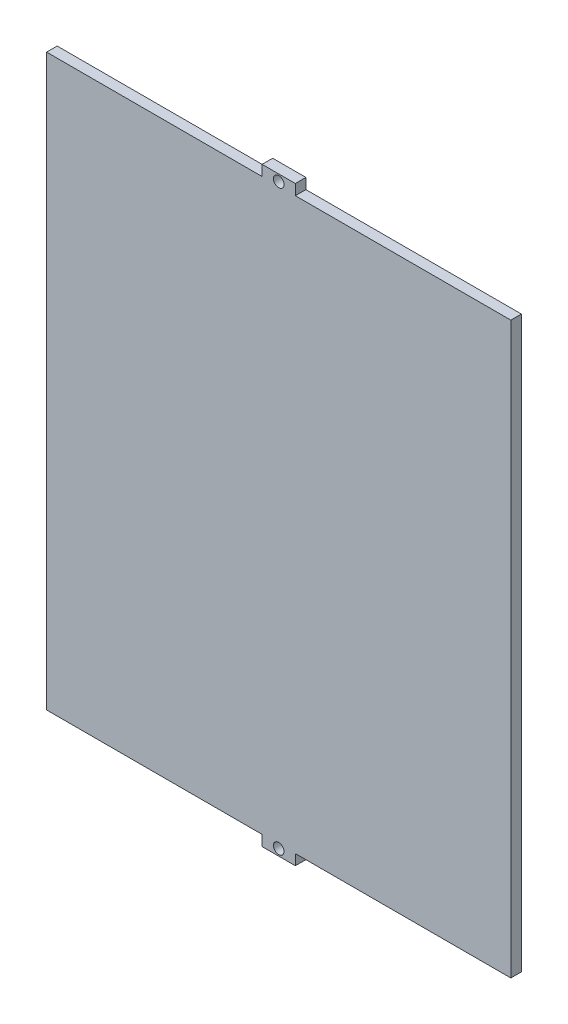
ISO-10303-21;
HEADER;
FILE_DESCRIPTION(('STEP AP214'),'2;1');
FILE_NAME('part.step','',(''),(''),'','','');
FILE_SCHEMA(('AUTOMOTIVE_DESIGN { 1 0 10303 214 1 1 1 1 }'));
ENDSEC;
DATA;
#1=APPLICATION_CONTEXT('core data for automotive mechanical design processes');
#2=APPLICATION_PROTOCOL_DEFINITION('international standard','automotive_design',2000,#1);
#3=PRODUCT_CONTEXT('',#1,'mechanical');
#4=PRODUCT('Part','Part','',(#3));
#5=PRODUCT_RELATED_PRODUCT_CATEGORY('part','',(#4));
#6=PRODUCT_DEFINITION_FORMATION('','',#4);
#7=PRODUCT_DEFINITION_CONTEXT('part definition',#1,'design');
#8=PRODUCT_DEFINITION('design','',#6,#7);
#9=PRODUCT_DEFINITION_SHAPE('','',#8);
#10=(LENGTH_UNIT() NAMED_UNIT(*) SI_UNIT(.MILLI.,.METRE.));
#11=(NAMED_UNIT(*) PLANE_ANGLE_UNIT() SI_UNIT($,.RADIAN.));
#12=(NAMED_UNIT(*) SI_UNIT($,.STERADIAN.) SOLID_ANGLE_UNIT());
#13=UNCERTAINTY_MEASURE_WITH_UNIT(LENGTH_MEASURE(1.E-05),#10,'distance_accuracy_value','');
#14=(GEOMETRIC_REPRESENTATION_CONTEXT(3) GLOBAL_UNCERTAINTY_ASSIGNED_CONTEXT((#13)) GLOBAL_UNIT_ASSIGNED_CONTEXT((#10,
#11,#12)) REPRESENTATION_CONTEXT('',''));
#15=CARTESIAN_POINT('',(0.,0.,0.));
#16=DIRECTION('',(0.,0.,1.));
#17=DIRECTION('',(1.,0.,0.));
#18=AXIS2_PLACEMENT_3D('',#15,#16,#17);
#19=CARTESIAN_POINT('',(69.85,88.9,3.18));
#20=DIRECTION('',(-1.,0.,0.));
#21=DIRECTION('',(0.,-1.,0.));
#22=AXIS2_PLACEMENT_3D('',#19,#20,#21);
#23=PLANE('',#22);
#24=DIRECTION('',(0.,1.,0.));
#25=VECTOR('',#24,1.);
#26=CARTESIAN_POINT('',(69.85,88.9,3.18));
#27=LINE('',#26,#25);
#28=CARTESIAN_POINT('',(69.85,-85.72,3.18));
#29=VERTEX_POINT('',#28);
#30=CARTESIAN_POINT('',(69.85,85.72,3.18));
#31=VERTEX_POINT('',#30);
#32=EDGE_CURVE('E150',#29,#31,#27,.T.);
#33=ORIENTED_EDGE('',*,*,#32,.F.);
#34=DIRECTION('',(0.,0.,1.));
#35=VECTOR('',#34,1.);
#36=CARTESIAN_POINT('',(69.85,-85.72,-6.82));
#37=LINE('',#36,#35);
#38=CARTESIAN_POINT('',(69.85,-85.72,0.));
#39=VERTEX_POINT('',#38);
#40=EDGE_CURVE('E225',#39,#29,#37,.T.);
#41=ORIENTED_EDGE('',*,*,#40,.F.);
#42=DIRECTION('',(0.,1.,0.));
#43=VECTOR('',#42,1.);
#44=CARTESIAN_POINT('',(69.85,88.9,0.));
#45=LINE('',#44,#43);
#46=CARTESIAN_POINT('',(69.85,85.72,0.));
#47=VERTEX_POINT('',#46);
#48=EDGE_CURVE('E162',#39,#47,#45,.T.);
#49=ORIENTED_EDGE('',*,*,#48,.T.);
#50=DIRECTION('',(0.,0.,1.));
#51=VECTOR('',#50,1.);
#52=CARTESIAN_POINT('',(69.85,85.72,-6.82));
#53=LINE('',#52,#51);
#54=EDGE_CURVE('E234',#47,#31,#53,.T.);
#55=ORIENTED_EDGE('',*,*,#54,.T.);
#56=EDGE_LOOP('',(#33,#41,#49,#55));
#57=FACE_BOUND('',#56,.T.);
#58=ADVANCED_FACE('F35',(#57),#23,.F.);
#59=CARTESIAN_POINT('',(-69.85,88.9,3.18));
#60=DIRECTION('',(0.,-1.,0.));
#61=DIRECTION('',(0.,0.,-1.));
#62=AXIS2_PLACEMENT_3D('',#59,#60,#61);
#63=PLANE('',#62);
#64=DIRECTION('',(-1.,0.,0.));
#65=VECTOR('',#64,1.);
#66=CARTESIAN_POINT('',(-69.85,88.9,0.));
#67=LINE('',#66,#65);
#68=CARTESIAN_POINT('',(5.,88.9,0.));
#69=VERTEX_POINT('',#68);
#70=CARTESIAN_POINT('',(-5.,88.9,0.));
#71=VERTEX_POINT('',#70);
#72=EDGE_CURVE('E165',#69,#71,#67,.T.);
#73=ORIENTED_EDGE('',*,*,#72,.T.);
#74=DIRECTION('',(0.,0.,1.));
#75=VECTOR('',#74,1.);
#76=CARTESIAN_POINT('',(-5.,88.9,-6.82));
#77=LINE('',#76,#75);
#78=CARTESIAN_POINT('',(-5.,88.9,3.18));
#79=VERTEX_POINT('',#78);
#80=EDGE_CURVE('E148',#71,#79,#77,.T.);
#81=ORIENTED_EDGE('',*,*,#80,.T.);
#82=DIRECTION('',(-1.,0.,0.));
#83=VECTOR('',#82,1.);
#84=CARTESIAN_POINT('',(-69.85,88.9,3.18));
#85=LINE('',#84,#83);
#86=CARTESIAN_POINT('',(5.,88.9,3.18));
#87=VERTEX_POINT('',#86);
#88=EDGE_CURVE('E143',#87,#79,#85,.T.);
#89=ORIENTED_EDGE('',*,*,#88,.F.);
#90=DIRECTION('',(0.,0.,1.));
#91=VECTOR('',#90,1.);
#92=CARTESIAN_POINT('',(5.,88.9,-6.82));
#93=LINE('',#92,#91);
#94=EDGE_CURVE('E125',#69,#87,#93,.T.);
#95=ORIENTED_EDGE('',*,*,#94,.F.);
#96=EDGE_LOOP('',(#73,#81,#89,#95));
#97=FACE_BOUND('',#96,.T.);
#98=ADVANCED_FACE('F147',(#97),#63,.F.);
#99=CARTESIAN_POINT('',(-69.85,88.9,3.18));
#100=DIRECTION('',(1.,0.,0.));
#101=DIRECTION('',(0.,1.,0.));
#102=AXIS2_PLACEMENT_3D('',#99,#100,#101);
#103=PLANE('',#102);
#104=DIRECTION('',(0.,-1.,0.));
#105=VECTOR('',#104,1.);
#106=CARTESIAN_POINT('',(-69.85,88.9,3.18));
#107=LINE('',#106,#105);
#108=CARTESIAN_POINT('',(-69.85,85.72,3.18));
#109=VERTEX_POINT('',#108);
#110=CARTESIAN_POINT('',(-69.85,-85.72,3.18));
#111=VERTEX_POINT('',#110);
#112=EDGE_CURVE('E149',#109,#111,#107,.T.);
#113=ORIENTED_EDGE('',*,*,#112,.F.);
#114=DIRECTION('',(0.,0.,1.));
#115=VECTOR('',#114,1.);
#116=CARTESIAN_POINT('',(-69.85,85.72,-6.82));
#117=LINE('',#116,#115);
#118=CARTESIAN_POINT('',(-69.85,85.72,0.));
#119=VERTEX_POINT('',#118);
#120=EDGE_CURVE('E215',#119,#109,#117,.T.);
#121=ORIENTED_EDGE('',*,*,#120,.F.);
#122=DIRECTION('',(0.,-1.,0.));
#123=VECTOR('',#122,1.);
#124=CARTESIAN_POINT('',(-69.85,88.9,0.));
#125=LINE('',#124,#123);
#126=CARTESIAN_POINT('',(-69.85,-85.72,0.));
#127=VERTEX_POINT('',#126);
#128=EDGE_CURVE('E167',#119,#127,#125,.T.);
#129=ORIENTED_EDGE('',*,*,#128,.T.);
#130=DIRECTION('',(0.,0.,1.));
#131=VECTOR('',#130,1.);
#132=CARTESIAN_POINT('',(-69.85,-85.72,-6.82));
#133=LINE('',#132,#131);
#134=EDGE_CURVE('E190',#127,#111,#133,.T.);
#135=ORIENTED_EDGE('',*,*,#134,.T.);
#136=EDGE_LOOP('',(#113,#121,#129,#135));
#137=FACE_BOUND('',#136,.T.);
#138=ADVANCED_FACE('F257',(#137),#103,.F.);
#139=CARTESIAN_POINT('',(-69.85,-88.9,3.18));
#140=DIRECTION('',(0.,1.,0.));
#141=DIRECTION('',(0.,0.,1.));
#142=AXIS2_PLACEMENT_3D('',#139,#140,#141);
#143=PLANE('',#142);
#144=DIRECTION('',(1.,0.,0.));
#145=VECTOR('',#144,1.);
#146=CARTESIAN_POINT('',(-69.85,-88.9,0.));
#147=LINE('',#146,#145);
#148=CARTESIAN_POINT('',(-5.,-88.9,0.));
#149=VERTEX_POINT('',#148);
#150=CARTESIAN_POINT('',(5.,-88.9,0.));
#151=VERTEX_POINT('',#150);
#152=EDGE_CURVE('E155',#149,#151,#147,.T.);
#153=ORIENTED_EDGE('',*,*,#152,.T.);
#154=DIRECTION('',(0.,0.,1.));
#155=VECTOR('',#154,1.);
#156=CARTESIAN_POINT('',(5.,-88.9,-6.82));
#157=LINE('',#156,#155);
#158=CARTESIAN_POINT('',(5.,-88.9,3.18));
#159=VERTEX_POINT('',#158);
#160=EDGE_CURVE('E211',#151,#159,#157,.T.);
#161=ORIENTED_EDGE('',*,*,#160,.T.);
#162=DIRECTION('',(1.,0.,0.));
#163=VECTOR('',#162,1.);
#164=CARTESIAN_POINT('',(-69.85,-88.9,3.18));
#165=LINE('',#164,#163);
#166=CARTESIAN_POINT('',(-5.,-88.9,3.18));
#167=VERTEX_POINT('',#166);
#168=EDGE_CURVE('E153',#167,#159,#165,.T.);
#169=ORIENTED_EDGE('',*,*,#168,.F.);
#170=DIRECTION('',(0.,0.,1.));
#171=VECTOR('',#170,1.);
#172=CARTESIAN_POINT('',(-5.,-88.9,-6.82));
#173=LINE('',#172,#171);
#174=EDGE_CURVE('E199',#149,#167,#173,.T.);
#175=ORIENTED_EDGE('',*,*,#174,.F.);
#176=EDGE_LOOP('',(#153,#161,#169,#175));
#177=FACE_BOUND('',#176,.T.);
#178=ADVANCED_FACE('F264',(#177),#143,.F.);
#179=CARTESIAN_POINT('',(0.,0.,3.18));
#180=DIRECTION('',(0.,0.,1.));
#181=DIRECTION('',(1.,0.,0.));
#182=AXIS2_PLACEMENT_3D('',#179,#180,#181);
#183=PLANE('',#182);
#184=CARTESIAN_POINT('',(0.,86.9,3.18));
#185=DIRECTION('',(0.,0.,1.));
#186=DIRECTION('',(-1.,0.,0.));
#187=AXIS2_PLACEMENT_3D('',#184,#185,#186);
#188=CIRCLE('',#187,1.59);
#189=CARTESIAN_POINT('',(-1.59,86.9,3.18));
#190=VERTEX_POINT('',#189);
#191=EDGE_CURVE('E231',#190,#190,#188,.T.);
#192=ORIENTED_EDGE('',*,*,#191,.F.);
#193=EDGE_LOOP('',(#192));
#194=FACE_BOUND('',#193,.T.);
#195=CARTESIAN_POINT('',(0.,-86.9,3.18));
#196=DIRECTION('',(0.,0.,1.));
#197=DIRECTION('',(1.,0.,0.));
#198=AXIS2_PLACEMENT_3D('',#195,#196,#197);
#199=CIRCLE('',#198,1.59);
#200=CARTESIAN_POINT('',(1.59,-86.9,3.18));
#201=VERTEX_POINT('',#200);
#202=EDGE_CURVE('E224',#201,#201,#199,.T.);
#203=ORIENTED_EDGE('',*,*,#202,.F.);
#204=EDGE_LOOP('',(#203));
#205=FACE_BOUND('',#204,.T.);
#206=DIRECTION('',(0.,1.,0.));
#207=VECTOR('',#206,1.);
#208=CARTESIAN_POINT('',(-5.,88.9,3.18));
#209=LINE('',#208,#207);
#210=CARTESIAN_POINT('',(-5.,85.72,3.18));
#211=VERTEX_POINT('',#210);
#212=EDGE_CURVE('E217',#211,#79,#209,.T.);
#213=ORIENTED_EDGE('',*,*,#212,.F.);
#214=DIRECTION('',(1.,0.,0.));
#215=VECTOR('',#214,1.);
#216=CARTESIAN_POINT('',(-69.85,85.72,3.18));
#217=LINE('',#216,#215);
#218=EDGE_CURVE('E222',#109,#211,#217,.T.);
#219=ORIENTED_EDGE('',*,*,#218,.F.);
#220=ORIENTED_EDGE('',*,*,#112,.T.);
#221=DIRECTION('',(-1.,0.,0.));
#222=VECTOR('',#221,1.);
#223=CARTESIAN_POINT('',(-69.85,-85.72,3.18));
#224=LINE('',#223,#222);
#225=CARTESIAN_POINT('',(-5.,-85.72,3.18));
#226=VERTEX_POINT('',#225);
#227=EDGE_CURVE('E202',#226,#111,#224,.T.);
#228=ORIENTED_EDGE('',*,*,#227,.F.);
#229=DIRECTION('',(0.,1.,0.));
#230=VECTOR('',#229,1.);
#231=CARTESIAN_POINT('',(-5.,-88.9,3.18));
#232=LINE('',#231,#230);
#233=EDGE_CURVE('E208',#167,#226,#232,.T.);
#234=ORIENTED_EDGE('',*,*,#233,.F.);
#235=ORIENTED_EDGE('',*,*,#168,.T.);
#236=DIRECTION('',(0.,-1.,0.));
#237=VECTOR('',#236,1.);
#238=CARTESIAN_POINT('',(5.,-88.9,3.18));
#239=LINE('',#238,#237);
#240=CARTESIAN_POINT('',(5.,-85.72,3.18));
#241=VERTEX_POINT('',#240);
#242=EDGE_CURVE('E227',#241,#159,#239,.T.);
#243=ORIENTED_EDGE('',*,*,#242,.F.);
#244=DIRECTION('',(-1.,0.,0.));
#245=VECTOR('',#244,1.);
#246=CARTESIAN_POINT('',(69.85,-85.72,3.18));
#247=LINE('',#246,#245);
#248=EDGE_CURVE('E220',#29,#241,#247,.T.);
#249=ORIENTED_EDGE('',*,*,#248,.F.);
#250=ORIENTED_EDGE('',*,*,#32,.T.);
#251=DIRECTION('',(1.,0.,0.));
#252=VECTOR('',#251,1.);
#253=CARTESIAN_POINT('',(69.85,85.72,3.18));
#254=LINE('',#253,#252);
#255=CARTESIAN_POINT('',(5.,85.72,3.18));
#256=VERTEX_POINT('',#255);
#257=EDGE_CURVE('E137',#256,#31,#254,.T.);
#258=ORIENTED_EDGE('',*,*,#257,.F.);
#259=DIRECTION('',(0.,-1.,0.));
#260=VECTOR('',#259,1.);
#261=CARTESIAN_POINT('',(5.,88.9,3.18));
#262=LINE('',#261,#260);
#263=EDGE_CURVE('E128',#87,#256,#262,.T.);
#264=ORIENTED_EDGE('',*,*,#263,.F.);
#265=ORIENTED_EDGE('',*,*,#88,.T.);
#266=EDGE_LOOP('',(#213,#219,#220,#228,#234,#235,#243,#249,#250,#258,#264,#265));
#267=FACE_BOUND('',#266,.T.);
#268=ADVANCED_FACE('F142',(#194,#205,#267),#183,.T.);
#269=CARTESIAN_POINT('',(0.,0.,0.));
#270=DIRECTION('',(0.,0.,1.));
#271=DIRECTION('',(1.,0.,0.));
#272=AXIS2_PLACEMENT_3D('',#269,#270,#271);
#273=PLANE('',#272);
#274=CARTESIAN_POINT('',(0.,86.9,0.));
#275=DIRECTION('',(0.,0.,1.));
#276=DIRECTION('',(1.,0.,0.));
#277=AXIS2_PLACEMENT_3D('',#274,#275,#276);
#278=CIRCLE('',#277,1.59);
#279=CARTESIAN_POINT('',(1.59,86.9,0.));
#280=VERTEX_POINT('',#279);
#281=EDGE_CURVE('E38',#280,#280,#278,.T.);
#282=ORIENTED_EDGE('',*,*,#281,.T.);
#283=EDGE_LOOP('',(#282));
#284=FACE_BOUND('',#283,.T.);
#285=CARTESIAN_POINT('',(0.,-86.9,0.));
#286=DIRECTION('',(0.,0.,1.));
#287=DIRECTION('',(1.,0.,0.));
#288=AXIS2_PLACEMENT_3D('',#285,#286,#287);
#289=CIRCLE('',#288,1.59);
#290=CARTESIAN_POINT('',(1.59,-86.9,0.));
#291=VERTEX_POINT('',#290);
#292=EDGE_CURVE('E188',#291,#291,#289,.T.);
#293=ORIENTED_EDGE('',*,*,#292,.T.);
#294=EDGE_LOOP('',(#293));
#295=FACE_BOUND('',#294,.T.);
#296=DIRECTION('',(1.,0.,0.));
#297=VECTOR('',#296,1.);
#298=CARTESIAN_POINT('',(0.,85.72,0.));
#299=LINE('',#298,#297);
#300=CARTESIAN_POINT('',(-5.,85.72,0.));
#301=VERTEX_POINT('',#300);
#302=EDGE_CURVE('E43',#119,#301,#299,.T.);
#303=ORIENTED_EDGE('',*,*,#302,.T.);
#304=DIRECTION('',(0.,1.,0.));
#305=VECTOR('',#304,1.);
#306=CARTESIAN_POINT('',(-4.99999999999986,0.,0.));
#307=LINE('',#306,#305);
#308=EDGE_CURVE('E11',#301,#71,#307,.T.);
#309=ORIENTED_EDGE('',*,*,#308,.T.);
#310=ORIENTED_EDGE('',*,*,#72,.F.);
#311=DIRECTION('',(0.,-1.,0.));
#312=VECTOR('',#311,1.);
#313=CARTESIAN_POINT('',(4.99999999999986,0.,0.));
#314=LINE('',#313,#312);
#315=CARTESIAN_POINT('',(5.,85.72,0.));
#316=VERTEX_POINT('',#315);
#317=EDGE_CURVE('E131',#69,#316,#314,.T.);
#318=ORIENTED_EDGE('',*,*,#317,.T.);
#319=DIRECTION('',(1.,0.,0.));
#320=VECTOR('',#319,1.);
#321=CARTESIAN_POINT('',(0.,85.72,0.));
#322=LINE('',#321,#320);
#323=EDGE_CURVE('E178',#316,#47,#322,.T.);
#324=ORIENTED_EDGE('',*,*,#323,.T.);
#325=ORIENTED_EDGE('',*,*,#48,.F.);
#326=DIRECTION('',(-1.,0.,0.));
#327=VECTOR('',#326,1.);
#328=CARTESIAN_POINT('',(0.,-85.72,0.));
#329=LINE('',#328,#327);
#330=CARTESIAN_POINT('',(5.,-85.72,0.));
#331=VERTEX_POINT('',#330);
#332=EDGE_CURVE('E181',#39,#331,#329,.T.);
#333=ORIENTED_EDGE('',*,*,#332,.T.);
#334=DIRECTION('',(0.,-1.,0.));
#335=VECTOR('',#334,1.);
#336=CARTESIAN_POINT('',(4.99999999999986,0.,0.));
#337=LINE('',#336,#335);
#338=EDGE_CURVE('E184',#331,#151,#337,.T.);
#339=ORIENTED_EDGE('',*,*,#338,.T.);
#340=ORIENTED_EDGE('',*,*,#152,.F.);
#341=DIRECTION('',(0.,1.,0.));
#342=VECTOR('',#341,1.);
#343=CARTESIAN_POINT('',(-4.99999999999986,0.,0.));
#344=LINE('',#343,#342);
#345=CARTESIAN_POINT('',(-5.,-85.72,0.));
#346=VERTEX_POINT('',#345);
#347=EDGE_CURVE('E161',#149,#346,#344,.T.);
#348=ORIENTED_EDGE('',*,*,#347,.T.);
#349=DIRECTION('',(-1.,0.,0.));
#350=VECTOR('',#349,1.);
#351=CARTESIAN_POINT('',(0.,-85.72,0.));
#352=LINE('',#351,#350);
#353=EDGE_CURVE('E174',#346,#127,#352,.T.);
#354=ORIENTED_EDGE('',*,*,#353,.T.);
#355=ORIENTED_EDGE('',*,*,#128,.F.);
#356=EDGE_LOOP('',(#303,#309,#310,#318,#324,#325,#333,#339,#340,#348,#354,#355));
#357=FACE_BOUND('',#356,.T.);
#358=ADVANCED_FACE('F251',(#284,#295,#357),#273,.F.);
#359=CARTESIAN_POINT('',(-69.85,-85.72,-6.82));
#360=DIRECTION('',(0.,1.,0.));
#361=DIRECTION('',(0.,0.,1.));
#362=AXIS2_PLACEMENT_3D('',#359,#360,#361);
#363=PLANE('',#362);
#364=DIRECTION('',(0.,0.,1.));
#365=VECTOR('',#364,1.);
#366=CARTESIAN_POINT('',(-5.,-85.72,-6.82));
#367=LINE('',#366,#365);
#368=EDGE_CURVE('E195',#346,#226,#367,.T.);
#369=ORIENTED_EDGE('',*,*,#368,.T.);
#370=ORIENTED_EDGE('',*,*,#227,.T.);
#371=ORIENTED_EDGE('',*,*,#134,.F.);
#372=ORIENTED_EDGE('',*,*,#353,.F.);
#373=EDGE_LOOP('',(#369,#370,#371,#372));
#374=FACE_BOUND('',#373,.T.);
#375=ADVANCED_FACE('F260',(#374),#363,.F.);
#376=CARTESIAN_POINT('',(-5.,-88.9,-6.82));
#377=DIRECTION('',(1.,0.,0.));
#378=DIRECTION('',(0.,1.,0.));
#379=AXIS2_PLACEMENT_3D('',#376,#377,#378);
#380=PLANE('',#379);
#381=ORIENTED_EDGE('',*,*,#174,.T.);
#382=ORIENTED_EDGE('',*,*,#233,.T.);
#383=ORIENTED_EDGE('',*,*,#368,.F.);
#384=ORIENTED_EDGE('',*,*,#347,.F.);
#385=EDGE_LOOP('',(#381,#382,#383,#384));
#386=FACE_BOUND('',#385,.T.);
#387=ADVANCED_FACE('F261',(#386),#380,.F.);
#388=CARTESIAN_POINT('',(69.85,85.72,-6.82));
#389=DIRECTION('',(0.,-1.,0.));
#390=DIRECTION('',(0.,0.,-1.));
#391=AXIS2_PLACEMENT_3D('',#388,#389,#390);
#392=PLANE('',#391);
#393=DIRECTION('',(0.,0.,1.));
#394=VECTOR('',#393,1.);
#395=CARTESIAN_POINT('',(5.,85.72,-6.82));
#396=LINE('',#395,#394);
#397=EDGE_CURVE('E136',#316,#256,#396,.T.);
#398=ORIENTED_EDGE('',*,*,#397,.T.);
#399=ORIENTED_EDGE('',*,*,#257,.T.);
#400=ORIENTED_EDGE('',*,*,#54,.F.);
#401=ORIENTED_EDGE('',*,*,#323,.F.);
#402=EDGE_LOOP('',(#398,#399,#400,#401));
#403=FACE_BOUND('',#402,.T.);
#404=ADVANCED_FACE('F241',(#403),#392,.F.);
#405=CARTESIAN_POINT('',(5.,88.9,-6.82));
#406=DIRECTION('',(-1.,0.,0.));
#407=DIRECTION('',(0.,-1.,0.));
#408=AXIS2_PLACEMENT_3D('',#405,#406,#407);
#409=PLANE('',#408);
#410=ORIENTED_EDGE('',*,*,#94,.T.);
#411=ORIENTED_EDGE('',*,*,#263,.T.);
#412=ORIENTED_EDGE('',*,*,#397,.F.);
#413=ORIENTED_EDGE('',*,*,#317,.F.);
#414=EDGE_LOOP('',(#410,#411,#412,#413));
#415=FACE_BOUND('',#414,.T.);
#416=ADVANCED_FACE('F127',(#415),#409,.F.);
#417=CARTESIAN_POINT('',(5.,-88.9,-6.82));
#418=DIRECTION('',(-1.,0.,0.));
#419=DIRECTION('',(0.,-1.,0.));
#420=AXIS2_PLACEMENT_3D('',#417,#418,#419);
#421=PLANE('',#420);
#422=DIRECTION('',(0.,0.,1.));
#423=VECTOR('',#422,1.);
#424=CARTESIAN_POINT('',(5.,-85.72,-6.82));
#425=LINE('',#424,#423);
#426=EDGE_CURVE('E59',#331,#241,#425,.T.);
#427=ORIENTED_EDGE('',*,*,#426,.T.);
#428=ORIENTED_EDGE('',*,*,#242,.T.);
#429=ORIENTED_EDGE('',*,*,#160,.F.);
#430=ORIENTED_EDGE('',*,*,#338,.F.);
#431=EDGE_LOOP('',(#427,#428,#429,#430));
#432=FACE_BOUND('',#431,.T.);
#433=ADVANCED_FACE('F266',(#432),#421,.F.);
#434=CARTESIAN_POINT('',(69.85,-85.72,-6.82));
#435=DIRECTION('',(0.,1.,0.));
#436=DIRECTION('',(0.,0.,1.));
#437=AXIS2_PLACEMENT_3D('',#434,#435,#436);
#438=PLANE('',#437);
#439=ORIENTED_EDGE('',*,*,#40,.T.);
#440=ORIENTED_EDGE('',*,*,#248,.T.);
#441=ORIENTED_EDGE('',*,*,#426,.F.);
#442=ORIENTED_EDGE('',*,*,#332,.F.);
#443=EDGE_LOOP('',(#439,#440,#441,#442));
#444=FACE_BOUND('',#443,.T.);
#445=ADVANCED_FACE('F249',(#444),#438,.F.);
#446=CARTESIAN_POINT('',(-5.,88.9,-6.82));
#447=DIRECTION('',(1.,0.,0.));
#448=DIRECTION('',(0.,1.,0.));
#449=AXIS2_PLACEMENT_3D('',#446,#447,#448);
#450=PLANE('',#449);
#451=DIRECTION('',(0.,0.,1.));
#452=VECTOR('',#451,1.);
#453=CARTESIAN_POINT('',(-5.,85.72,-6.82));
#454=LINE('',#453,#452);
#455=EDGE_CURVE('E51',#301,#211,#454,.T.);
#456=ORIENTED_EDGE('',*,*,#455,.T.);
#457=ORIENTED_EDGE('',*,*,#212,.T.);
#458=ORIENTED_EDGE('',*,*,#80,.F.);
#459=ORIENTED_EDGE('',*,*,#308,.F.);
#460=EDGE_LOOP('',(#456,#457,#458,#459));
#461=FACE_BOUND('',#460,.T.);
#462=ADVANCED_FACE('F254',(#461),#450,.F.);
#463=CARTESIAN_POINT('',(-69.85,85.72,-6.82));
#464=DIRECTION('',(0.,-1.,0.));
#465=DIRECTION('',(0.,0.,-1.));
#466=AXIS2_PLACEMENT_3D('',#463,#464,#465);
#467=PLANE('',#466);
#468=ORIENTED_EDGE('',*,*,#120,.T.);
#469=ORIENTED_EDGE('',*,*,#218,.T.);
#470=ORIENTED_EDGE('',*,*,#455,.F.);
#471=ORIENTED_EDGE('',*,*,#302,.F.);
#472=EDGE_LOOP('',(#468,#469,#470,#471));
#473=FACE_BOUND('',#472,.T.);
#474=ADVANCED_FACE('F297',(#473),#467,.F.);
#475=CARTESIAN_POINT('',(0.,-86.9,-6.82));
#476=DIRECTION('',(0.,0.,1.));
#477=DIRECTION('',(1.,0.,0.));
#478=AXIS2_PLACEMENT_3D('',#475,#476,#477);
#479=CYLINDRICAL_SURFACE('',#478,1.59);
#480=ORIENTED_EDGE('',*,*,#202,.T.);
#481=EDGE_LOOP('',(#480));
#482=FACE_BOUND('',#481,.T.);
#483=ORIENTED_EDGE('',*,*,#292,.F.);
#484=EDGE_LOOP('',(#483));
#485=FACE_BOUND('',#484,.T.);
#486=ADVANCED_FACE('F300',(#482,#485),#479,.F.);
#487=CARTESIAN_POINT('',(0.,86.9,-6.82));
#488=DIRECTION('',(0.,0.,1.));
#489=DIRECTION('',(1.,0.,0.));
#490=AXIS2_PLACEMENT_3D('',#487,#488,#489);
#491=CYLINDRICAL_SURFACE('',#490,1.59);
#492=ORIENTED_EDGE('',*,*,#191,.T.);
#493=EDGE_LOOP('',(#492));
#494=FACE_BOUND('',#493,.T.);
#495=ORIENTED_EDGE('',*,*,#281,.F.);
#496=EDGE_LOOP('',(#495));
#497=FACE_BOUND('',#496,.T.);
#498=ADVANCED_FACE('F316',(#494,#497),#491,.F.);
#499=CLOSED_SHELL('',(#58,#98,#138,#178,#268,#358,#375,#387,#404,#416,#433,#445,#462,#474,#486,#498));
#500=MANIFOLD_SOLID_BREP('B2',#499);
#501=ADVANCED_BREP_SHAPE_REPRESENTATION('',(#18,#500),#14);
#502=SHAPE_DEFINITION_REPRESENTATION(#9,#501);
ENDSEC;
END-ISO-10303-21;
